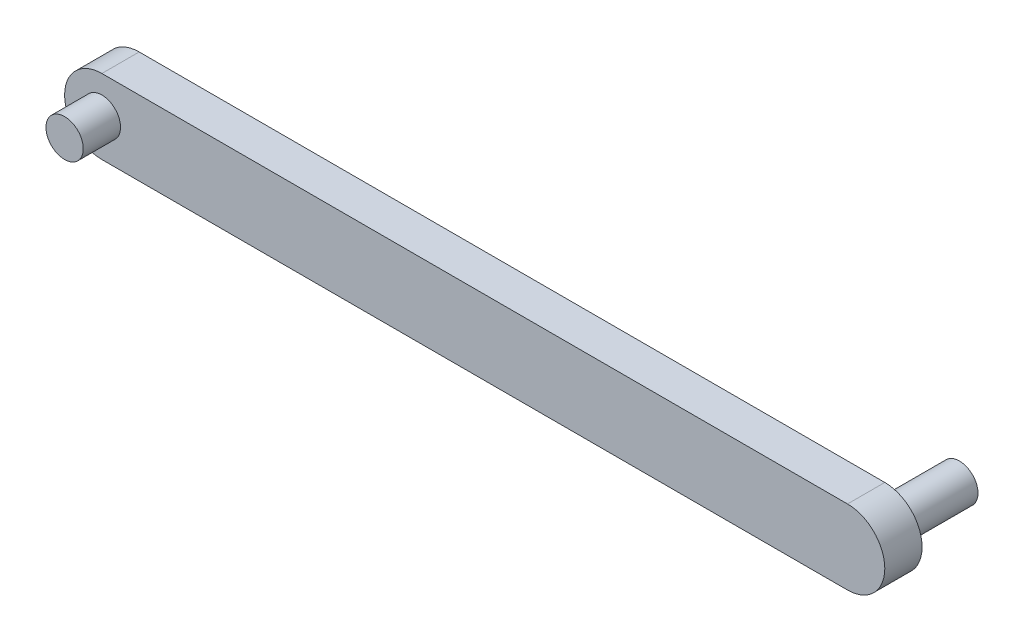
ISO-10303-21;
HEADER;
FILE_DESCRIPTION(('STEP AP214'),'2;1');
FILE_NAME('part.step','',(''),(''),'','','');
FILE_SCHEMA(('AUTOMOTIVE_DESIGN { 1 0 10303 214 1 1 1 1 }'));
ENDSEC;
DATA;
#1=APPLICATION_CONTEXT('core data for automotive mechanical design processes');
#2=APPLICATION_PROTOCOL_DEFINITION('international standard','automotive_design',2000,#1);
#3=PRODUCT_CONTEXT('',#1,'mechanical');
#4=PRODUCT('Part','Part','',(#3));
#5=PRODUCT_RELATED_PRODUCT_CATEGORY('part','',(#4));
#6=PRODUCT_DEFINITION_FORMATION('','',#4);
#7=PRODUCT_DEFINITION_CONTEXT('part definition',#1,'design');
#8=PRODUCT_DEFINITION('design','',#6,#7);
#9=PRODUCT_DEFINITION_SHAPE('','',#8);
#10=(LENGTH_UNIT() NAMED_UNIT(*) SI_UNIT(.MILLI.,.METRE.));
#11=(NAMED_UNIT(*) PLANE_ANGLE_UNIT() SI_UNIT($,.RADIAN.));
#12=(NAMED_UNIT(*) SI_UNIT($,.STERADIAN.) SOLID_ANGLE_UNIT());
#13=UNCERTAINTY_MEASURE_WITH_UNIT(LENGTH_MEASURE(1.E-05),#10,'distance_accuracy_value','');
#14=(GEOMETRIC_REPRESENTATION_CONTEXT(3) GLOBAL_UNCERTAINTY_ASSIGNED_CONTEXT((#13)) GLOBAL_UNIT_ASSIGNED_CONTEXT((#10,
#11,#12)) REPRESENTATION_CONTEXT('',''));
#15=CARTESIAN_POINT('',(0.,0.,0.));
#16=DIRECTION('',(0.,0.,1.));
#17=DIRECTION('',(1.,0.,0.));
#18=AXIS2_PLACEMENT_3D('',#15,#16,#17);
#19=CARTESIAN_POINT('',(-33.6343708573143,0.,4.));
#20=DIRECTION('',(0.,0.,1.));
#21=DIRECTION('',(1.,0.,0.));
#22=AXIS2_PLACEMENT_3D('',#19,#20,#21);
#23=PLANE('',#22);
#24=CARTESIAN_POINT('',(-33.6343708573143,0.,4.));
#25=DIRECTION('',(0.,0.,1.));
#26=DIRECTION('',(1.,0.,0.));
#27=AXIS2_PLACEMENT_3D('',#24,#25,#26);
#28=CIRCLE('',#27,4.);
#29=CARTESIAN_POINT('',(-33.6343708573143,4.,4.));
#30=VERTEX_POINT('',#29);
#31=CARTESIAN_POINT('',(-33.6343708573143,-4.,4.));
#32=VERTEX_POINT('',#31);
#33=EDGE_CURVE('E84',#30,#32,#28,.T.);
#34=ORIENTED_EDGE('',*,*,#33,.T.);
#35=DIRECTION('',(1.,0.,0.));
#36=VECTOR('',#35,1.);
#37=CARTESIAN_POINT('',(-33.6343708573143,-4.,4.));
#38=LINE('',#37,#36);
#39=CARTESIAN_POINT('',(46.3656291426857,-4.,4.));
#40=VERTEX_POINT('',#39);
#41=EDGE_CURVE('E79',#32,#40,#38,.T.);
#42=ORIENTED_EDGE('',*,*,#41,.T.);
#43=CARTESIAN_POINT('',(46.3656291426857,0.,4.));
#44=DIRECTION('',(0.,0.,1.));
#45=DIRECTION('',(1.,0.,0.));
#46=AXIS2_PLACEMENT_3D('',#43,#44,#45);
#47=CIRCLE('',#46,4.);
#48=CARTESIAN_POINT('',(46.3656291426857,4.,4.));
#49=VERTEX_POINT('',#48);
#50=EDGE_CURVE('E82',#40,#49,#47,.T.);
#51=ORIENTED_EDGE('',*,*,#50,.T.);
#52=DIRECTION('',(-1.,0.,0.));
#53=VECTOR('',#52,1.);
#54=CARTESIAN_POINT('',(-33.6343708573143,4.,4.));
#55=LINE('',#54,#53);
#56=EDGE_CURVE('E48',#49,#30,#55,.T.);
#57=ORIENTED_EDGE('',*,*,#56,.T.);
#58=EDGE_LOOP('',(#34,#42,#51,#57));
#59=FACE_BOUND('',#58,.T.);
#60=CARTESIAN_POINT('',(-33.6343708573143,0.,4.));
#61=DIRECTION('',(0.,0.,1.));
#62=DIRECTION('',(1.,0.,0.));
#63=AXIS2_PLACEMENT_3D('',#60,#61,#62);
#64=CIRCLE('',#63,2.);
#65=CARTESIAN_POINT('',(-31.6343708573143,0.,4.));
#66=VERTEX_POINT('',#65);
#67=EDGE_CURVE('E190',#66,#66,#64,.T.);
#68=ORIENTED_EDGE('',*,*,#67,.F.);
#69=EDGE_LOOP('',(#68));
#70=FACE_BOUND('',#69,.T.);
#71=ADVANCED_FACE('F31',(#59,#70),#23,.T.);
#72=CARTESIAN_POINT('',(-33.6343708573143,0.,0.));
#73=DIRECTION('',(0.,0.,1.));
#74=DIRECTION('',(1.,0.,0.));
#75=AXIS2_PLACEMENT_3D('',#72,#73,#74);
#76=PLANE('',#75);
#77=CARTESIAN_POINT('',(-33.6343708573143,0.,0.));
#78=DIRECTION('',(0.,0.,1.));
#79=DIRECTION('',(1.,0.,0.));
#80=AXIS2_PLACEMENT_3D('',#77,#78,#79);
#81=CIRCLE('',#80,4.);
#82=CARTESIAN_POINT('',(-33.6343708573143,4.,0.));
#83=VERTEX_POINT('',#82);
#84=CARTESIAN_POINT('',(-33.6343708573143,-4.,0.));
#85=VERTEX_POINT('',#84);
#86=EDGE_CURVE('E98',#83,#85,#81,.T.);
#87=ORIENTED_EDGE('',*,*,#86,.F.);
#88=DIRECTION('',(-1.,0.,0.));
#89=VECTOR('',#88,1.);
#90=CARTESIAN_POINT('',(-33.6343708573143,4.,0.));
#91=LINE('',#90,#89);
#92=CARTESIAN_POINT('',(46.3656291426857,4.,0.));
#93=VERTEX_POINT('',#92);
#94=EDGE_CURVE('E71',#93,#83,#91,.T.);
#95=ORIENTED_EDGE('',*,*,#94,.F.);
#96=CARTESIAN_POINT('',(46.3656291426857,0.,0.));
#97=DIRECTION('',(0.,0.,1.));
#98=DIRECTION('',(1.,0.,0.));
#99=AXIS2_PLACEMENT_3D('',#96,#97,#98);
#100=CIRCLE('',#99,4.);
#101=CARTESIAN_POINT('',(46.3656291426857,-4.,0.));
#102=VERTEX_POINT('',#101);
#103=EDGE_CURVE('E65',#102,#93,#100,.T.);
#104=ORIENTED_EDGE('',*,*,#103,.F.);
#105=DIRECTION('',(1.,0.,0.));
#106=VECTOR('',#105,1.);
#107=CARTESIAN_POINT('',(-33.6343708573143,-4.,0.));
#108=LINE('',#107,#106);
#109=EDGE_CURVE('E89',#85,#102,#108,.T.);
#110=ORIENTED_EDGE('',*,*,#109,.F.);
#111=EDGE_LOOP('',(#87,#95,#104,#110));
#112=FACE_BOUND('',#111,.T.);
#113=CARTESIAN_POINT('',(46.3656291426857,0.,0.));
#114=DIRECTION('',(0.,0.,1.));
#115=DIRECTION('',(1.,0.,0.));
#116=AXIS2_PLACEMENT_3D('',#113,#114,#115);
#117=CIRCLE('',#116,2.);
#118=CARTESIAN_POINT('',(48.3656291426857,0.,0.));
#119=VERTEX_POINT('',#118);
#120=EDGE_CURVE('E11',#119,#119,#117,.F.);
#121=ORIENTED_EDGE('',*,*,#120,.F.);
#122=EDGE_LOOP('',(#121));
#123=FACE_BOUND('',#122,.T.);
#124=ADVANCED_FACE('F109',(#112,#123),#76,.F.);
#125=CARTESIAN_POINT('',(-33.6343708573143,0.,4.));
#126=DIRECTION('',(0.,0.,-1.));
#127=DIRECTION('',(-1.,0.,0.));
#128=AXIS2_PLACEMENT_3D('',#125,#126,#127);
#129=CYLINDRICAL_SURFACE('',#128,4.);
#130=ORIENTED_EDGE('',*,*,#86,.T.);
#131=DIRECTION('',(0.,0.,-1.));
#132=VECTOR('',#131,1.);
#133=CARTESIAN_POINT('',(-33.6343708573143,-4.,4.));
#134=LINE('',#133,#132);
#135=EDGE_CURVE('E40',#32,#85,#134,.T.);
#136=ORIENTED_EDGE('',*,*,#135,.F.);
#137=ORIENTED_EDGE('',*,*,#33,.F.);
#138=DIRECTION('',(0.,0.,-1.));
#139=VECTOR('',#138,1.);
#140=CARTESIAN_POINT('',(-33.6343708573143,4.,4.));
#141=LINE('',#140,#139);
#142=EDGE_CURVE('E94',#30,#83,#141,.T.);
#143=ORIENTED_EDGE('',*,*,#142,.T.);
#144=EDGE_LOOP('',(#130,#136,#137,#143));
#145=FACE_BOUND('',#144,.T.);
#146=ADVANCED_FACE('F33',(#145),#129,.T.);
#147=CARTESIAN_POINT('',(-33.6343708573143,-4.,4.));
#148=DIRECTION('',(0.,1.,0.));
#149=DIRECTION('',(0.,0.,1.));
#150=AXIS2_PLACEMENT_3D('',#147,#148,#149);
#151=PLANE('',#150);
#152=ORIENTED_EDGE('',*,*,#109,.T.);
#153=DIRECTION('',(0.,0.,-1.));
#154=VECTOR('',#153,1.);
#155=CARTESIAN_POINT('',(46.3656291426857,-4.,4.));
#156=LINE('',#155,#154);
#157=EDGE_CURVE('E87',#40,#102,#156,.T.);
#158=ORIENTED_EDGE('',*,*,#157,.F.);
#159=ORIENTED_EDGE('',*,*,#41,.F.);
#160=ORIENTED_EDGE('',*,*,#135,.T.);
#161=EDGE_LOOP('',(#152,#158,#159,#160));
#162=FACE_BOUND('',#161,.T.);
#163=ADVANCED_FACE('F88',(#162),#151,.F.);
#164=CARTESIAN_POINT('',(46.3656291426857,0.,4.));
#165=DIRECTION('',(0.,0.,-1.));
#166=DIRECTION('',(-1.,0.,0.));
#167=AXIS2_PLACEMENT_3D('',#164,#165,#166);
#168=CYLINDRICAL_SURFACE('',#167,4.);
#169=ORIENTED_EDGE('',*,*,#103,.T.);
#170=DIRECTION('',(0.,0.,-1.));
#171=VECTOR('',#170,1.);
#172=CARTESIAN_POINT('',(46.3656291426857,4.,4.));
#173=LINE('',#172,#171);
#174=EDGE_CURVE('E90',#49,#93,#173,.T.);
#175=ORIENTED_EDGE('',*,*,#174,.F.);
#176=ORIENTED_EDGE('',*,*,#50,.F.);
#177=ORIENTED_EDGE('',*,*,#157,.T.);
#178=EDGE_LOOP('',(#169,#175,#176,#177));
#179=FACE_BOUND('',#178,.T.);
#180=ADVANCED_FACE('F92',(#179),#168,.T.);
#181=CARTESIAN_POINT('',(-33.6343708573143,4.,4.));
#182=DIRECTION('',(0.,-1.,0.));
#183=DIRECTION('',(0.,0.,-1.));
#184=AXIS2_PLACEMENT_3D('',#181,#182,#183);
#185=PLANE('',#184);
#186=ORIENTED_EDGE('',*,*,#94,.T.);
#187=ORIENTED_EDGE('',*,*,#142,.F.);
#188=ORIENTED_EDGE('',*,*,#56,.F.);
#189=ORIENTED_EDGE('',*,*,#174,.T.);
#190=EDGE_LOOP('',(#186,#187,#188,#189));
#191=FACE_BOUND('',#190,.T.);
#192=ADVANCED_FACE('F118',(#191),#185,.F.);
#193=CARTESIAN_POINT('',(46.3656291426857,0.,-8.));
#194=DIRECTION('',(0.,0.,1.));
#195=DIRECTION('',(1.,0.,0.));
#196=AXIS2_PLACEMENT_3D('',#193,#194,#195);
#197=CYLINDRICAL_SURFACE('',#196,2.);
#198=CARTESIAN_POINT('',(46.3656291426857,0.,-8.));
#199=DIRECTION('',(0.,0.,-1.));
#200=DIRECTION('',(-1.,0.,0.));
#201=AXIS2_PLACEMENT_3D('',#198,#199,#200);
#202=CIRCLE('',#201,2.);
#203=CARTESIAN_POINT('',(44.3656291426857,0.,-8.));
#204=VERTEX_POINT('',#203);
#205=EDGE_CURVE('E101',#204,#204,#202,.T.);
#206=ORIENTED_EDGE('',*,*,#205,.F.);
#207=EDGE_LOOP('',(#206));
#208=FACE_BOUND('',#207,.T.);
#209=ORIENTED_EDGE('',*,*,#120,.T.);
#210=EDGE_LOOP('',(#209));
#211=FACE_BOUND('',#210,.T.);
#212=ADVANCED_FACE('F115',(#208,#211),#197,.T.);
#213=CARTESIAN_POINT('',(46.3656291426857,0.,-8.));
#214=DIRECTION('',(0.,0.,-1.));
#215=DIRECTION('',(-1.,0.,0.));
#216=AXIS2_PLACEMENT_3D('',#213,#214,#215);
#217=PLANE('',#216);
#218=ORIENTED_EDGE('',*,*,#205,.T.);
#219=EDGE_LOOP('',(#218));
#220=FACE_BOUND('',#219,.T.);
#221=ADVANCED_FACE('F117',(#220),#217,.T.);
#222=CARTESIAN_POINT('',(-33.6343708573143,0.,8.));
#223=DIRECTION('',(0.,0.,-1.));
#224=DIRECTION('',(-1.,0.,0.));
#225=AXIS2_PLACEMENT_3D('',#222,#223,#224);
#226=CYLINDRICAL_SURFACE('',#225,2.);
#227=CARTESIAN_POINT('',(-33.6343708573143,0.,8.));
#228=DIRECTION('',(0.,0.,1.));
#229=DIRECTION('',(1.,0.,0.));
#230=AXIS2_PLACEMENT_3D('',#227,#228,#229);
#231=CIRCLE('',#230,2.);
#232=CARTESIAN_POINT('',(-31.6343708573143,0.,8.));
#233=VERTEX_POINT('',#232);
#234=EDGE_CURVE('E189',#233,#233,#231,.T.);
#235=ORIENTED_EDGE('',*,*,#234,.F.);
#236=EDGE_LOOP('',(#235));
#237=FACE_BOUND('',#236,.T.);
#238=ORIENTED_EDGE('',*,*,#67,.T.);
#239=EDGE_LOOP('',(#238));
#240=FACE_BOUND('',#239,.T.);
#241=ADVANCED_FACE('F125',(#237,#240),#226,.T.);
#242=CARTESIAN_POINT('',(-33.6343708573143,0.,8.));
#243=DIRECTION('',(0.,0.,1.));
#244=DIRECTION('',(1.,0.,0.));
#245=AXIS2_PLACEMENT_3D('',#242,#243,#244);
#246=PLANE('',#245);
#247=ORIENTED_EDGE('',*,*,#234,.T.);
#248=EDGE_LOOP('',(#247));
#249=FACE_BOUND('',#248,.T.);
#250=ADVANCED_FACE('F173',(#249),#246,.T.);
#251=CLOSED_SHELL('',(#71,#124,#146,#163,#180,#192,#212,#221,#241,#250));
#252=MANIFOLD_SOLID_BREP('B2',#251);
#253=ADVANCED_BREP_SHAPE_REPRESENTATION('',(#18,#252),#14);
#254=SHAPE_DEFINITION_REPRESENTATION(#9,#253);
ENDSEC;
END-ISO-10303-21;
